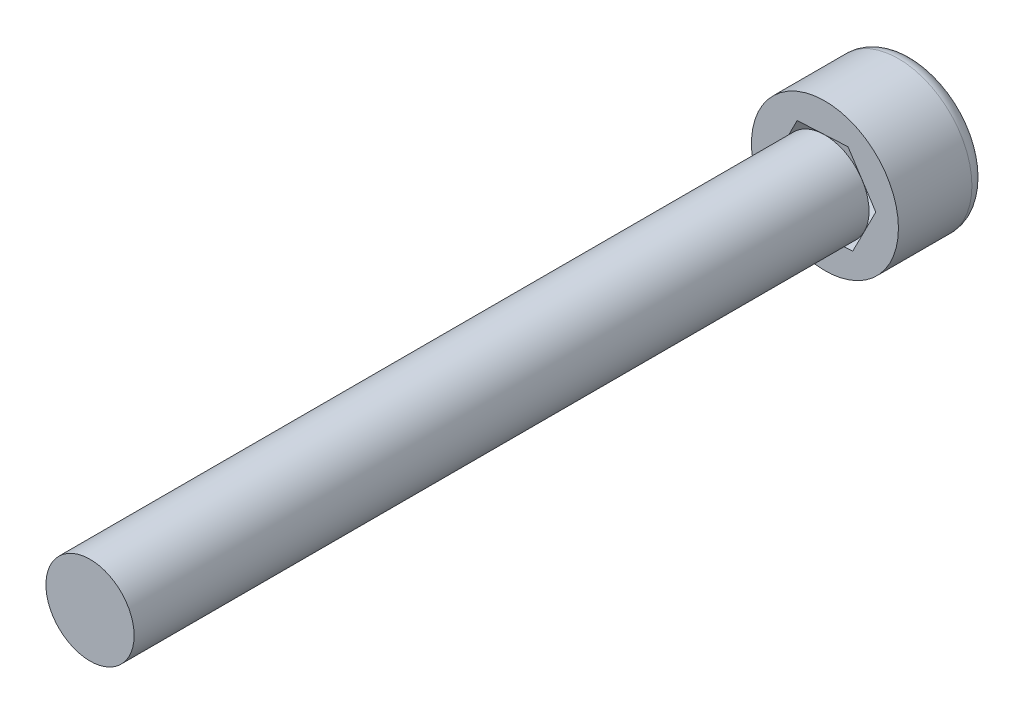
ISO-10303-21;
HEADER;
FILE_DESCRIPTION(('STEP AP214'),'2;1');
FILE_NAME('part.step','',(''),(''),'','','');
FILE_SCHEMA(('AUTOMOTIVE_DESIGN { 1 0 10303 214 1 1 1 1 }'));
ENDSEC;
DATA;
#1=APPLICATION_CONTEXT('core data for automotive mechanical design processes');
#2=APPLICATION_PROTOCOL_DEFINITION('international standard','automotive_design',2000,#1);
#3=PRODUCT_CONTEXT('',#1,'mechanical');
#4=PRODUCT('Part','Part','',(#3));
#5=PRODUCT_RELATED_PRODUCT_CATEGORY('part','',(#4));
#6=PRODUCT_DEFINITION_FORMATION('','',#4);
#7=PRODUCT_DEFINITION_CONTEXT('part definition',#1,'design');
#8=PRODUCT_DEFINITION('design','',#6,#7);
#9=PRODUCT_DEFINITION_SHAPE('','',#8);
#10=(LENGTH_UNIT() NAMED_UNIT(*) SI_UNIT(.MILLI.,.METRE.));
#11=(NAMED_UNIT(*) PLANE_ANGLE_UNIT() SI_UNIT($,.RADIAN.));
#12=(NAMED_UNIT(*) SI_UNIT($,.STERADIAN.) SOLID_ANGLE_UNIT());
#13=UNCERTAINTY_MEASURE_WITH_UNIT(LENGTH_MEASURE(1.E-05),#10,'distance_accuracy_value','');
#14=(GEOMETRIC_REPRESENTATION_CONTEXT(3) GLOBAL_UNCERTAINTY_ASSIGNED_CONTEXT((#13)) GLOBAL_UNIT_ASSIGNED_CONTEXT((#10,
#11,#12)) REPRESENTATION_CONTEXT('',''));
#15=CARTESIAN_POINT('',(0.,0.,0.));
#16=DIRECTION('',(0.,0.,1.));
#17=DIRECTION('',(1.,0.,0.));
#18=AXIS2_PLACEMENT_3D('',#15,#16,#17);
#19=CARTESIAN_POINT('',(0.,0.,3.));
#20=DIRECTION('',(0.,0.,-1.));
#21=DIRECTION('',(-1.,0.,0.));
#22=AXIS2_PLACEMENT_3D('',#19,#20,#21);
#23=CYLINDRICAL_SURFACE('',#22,2.5);
#24=CARTESIAN_POINT('',(0.,0.,0.5));
#25=DIRECTION('',(0.,0.,1.));
#26=DIRECTION('',(1.,0.,0.));
#27=AXIS2_PLACEMENT_3D('',#24,#25,#26);
#28=CIRCLE('',#27,2.5);
#29=CARTESIAN_POINT('',(2.5,0.,0.5));
#30=VERTEX_POINT('',#29);
#31=EDGE_CURVE('E50',#30,#30,#28,.T.);
#32=ORIENTED_EDGE('',*,*,#31,.T.);
#33=EDGE_LOOP('',(#32));
#34=FACE_BOUND('',#33,.T.);
#35=CARTESIAN_POINT('',(0.,0.,3.));
#36=DIRECTION('',(0.,0.,1.));
#37=DIRECTION('',(1.,0.,0.));
#38=AXIS2_PLACEMENT_3D('',#35,#36,#37);
#39=CIRCLE('',#38,2.5);
#40=CARTESIAN_POINT('',(2.5,0.,3.));
#41=VERTEX_POINT('',#40);
#42=EDGE_CURVE('E165',#41,#41,#39,.T.);
#43=ORIENTED_EDGE('',*,*,#42,.F.);
#44=EDGE_LOOP('',(#43));
#45=FACE_BOUND('',#44,.T.);
#46=ADVANCED_FACE('F41',(#34,#45),#23,.T.);
#47=CARTESIAN_POINT('',(0.,0.,3.));
#48=DIRECTION('',(0.,0.,1.));
#49=DIRECTION('',(1.,0.,0.));
#50=AXIS2_PLACEMENT_3D('',#47,#48,#49);
#51=PLANE('',#50);
#52=DIRECTION('',(-0.998565318577122,-0.0535472178079434,0.));
#53=VECTOR('',#52,1.);
#54=CARTESIAN_POINT('',(0.945103759937804,-1.45147472694203,3.));
#55=LINE('',#54,#53);
#56=CARTESIAN_POINT('',(0.945103759937804,-1.45147472694203,3.));
#57=VERTEX_POINT('',#56);
#58=CARTESIAN_POINT('',(-0.784462106513973,-1.54422122878934,3.));
#59=VERTEX_POINT('',#58);
#60=EDGE_CURVE('E94',#57,#59,#55,.T.);
#61=ORIENTED_EDGE('',*,*,#60,.T.);
#62=DIRECTION('',(-0.545655910212218,0.838009324321917,0.));
#63=VECTOR('',#62,1.);
#64=CARTESIAN_POINT('',(-0.784462106513973,-1.54422122878934,3.));
#65=LINE('',#64,#63);
#66=CARTESIAN_POINT('',(-1.72956586645178,-0.0927465018473138,3.));
#67=VERTEX_POINT('',#66);
#68=EDGE_CURVE('E57',#59,#67,#65,.T.);
#69=ORIENTED_EDGE('',*,*,#68,.T.);
#70=DIRECTION('',(0.452909408364904,0.89155654212986,0.));
#71=VECTOR('',#70,1.);
#72=CARTESIAN_POINT('',(-1.72956586645178,-0.0927465018473138,3.));
#73=LINE('',#72,#71);
#74=CARTESIAN_POINT('',(-0.945103759937803,1.45147472694203,3.));
#75=VERTEX_POINT('',#74);
#76=EDGE_CURVE('E104',#67,#75,#73,.T.);
#77=ORIENTED_EDGE('',*,*,#76,.T.);
#78=DIRECTION('',(0.998565318577122,0.0535472178079431,0.));
#79=VECTOR('',#78,1.);
#80=CARTESIAN_POINT('',(-0.945103759937803,1.45147472694203,3.));
#81=LINE('',#80,#79);
#82=CARTESIAN_POINT('',(0.784462106513974,1.54422122878934,3.));
#83=VERTEX_POINT('',#82);
#84=EDGE_CURVE('E176',#75,#83,#81,.T.);
#85=ORIENTED_EDGE('',*,*,#84,.T.);
#86=DIRECTION('',(0.545655910212218,-0.838009324321917,0.));
#87=VECTOR('',#86,1.);
#88=CARTESIAN_POINT('',(0.784462106513974,1.54422122878934,3.));
#89=LINE('',#88,#87);
#90=CARTESIAN_POINT('',(1.72956586645178,0.0927465018473145,3.));
#91=VERTEX_POINT('',#90);
#92=EDGE_CURVE('E174',#83,#91,#89,.T.);
#93=ORIENTED_EDGE('',*,*,#92,.T.);
#94=DIRECTION('',(-0.452909408364904,-0.89155654212986,0.));
#95=VECTOR('',#94,1.);
#96=CARTESIAN_POINT('',(1.72956586645178,0.0927465018473145,3.));
#97=LINE('',#96,#95);
#98=EDGE_CURVE('E109',#91,#57,#97,.T.);
#99=ORIENTED_EDGE('',*,*,#98,.T.);
#100=EDGE_LOOP('',(#61,#69,#77,#85,#93,#99));
#101=FACE_BOUND('',#100,.T.);
#102=ORIENTED_EDGE('',*,*,#42,.T.);
#103=EDGE_LOOP('',(#102));
#104=FACE_BOUND('',#103,.T.);
#105=ADVANCED_FACE('F106',(#101,#104),#51,.T.);
#106=CARTESIAN_POINT('',(0.,0.,0.));
#107=DIRECTION('',(0.,0.,1.));
#108=DIRECTION('',(1.,0.,0.));
#109=AXIS2_PLACEMENT_3D('',#106,#107,#108);
#110=PLANE('',#109);
#111=CARTESIAN_POINT('',(0.,0.,0.));
#112=DIRECTION('',(0.,0.,1.));
#113=DIRECTION('',(1.,0.,0.));
#114=AXIS2_PLACEMENT_3D('',#111,#112,#113);
#115=CIRCLE('',#114,2.);
#116=CARTESIAN_POINT('',(2.,0.,0.));
#117=VERTEX_POINT('',#116);
#118=EDGE_CURVE('E12',#117,#117,#115,.F.);
#119=ORIENTED_EDGE('',*,*,#118,.T.);
#120=EDGE_LOOP('',(#119));
#121=FACE_BOUND('',#120,.T.);
#122=DIRECTION('',(-0.545655910212218,0.838009324321917,0.));
#123=VECTOR('',#122,1.);
#124=CARTESIAN_POINT('',(-0.784462106513973,-1.54422122878934,0.));
#125=LINE('',#124,#123);
#126=CARTESIAN_POINT('',(-0.784462106513973,-1.54422122878934,0.));
#127=VERTEX_POINT('',#126);
#128=CARTESIAN_POINT('',(-1.72956586645178,-0.0927465018473138,0.));
#129=VERTEX_POINT('',#128);
#130=EDGE_CURVE('E99',#127,#129,#125,.T.);
#131=ORIENTED_EDGE('',*,*,#130,.F.);
#132=DIRECTION('',(-0.998565318577122,-0.0535472178079434,0.));
#133=VECTOR('',#132,1.);
#134=CARTESIAN_POINT('',(0.945103759937804,-1.45147472694203,0.));
#135=LINE('',#134,#133);
#136=CARTESIAN_POINT('',(0.945103759937804,-1.45147472694203,0.));
#137=VERTEX_POINT('',#136);
#138=EDGE_CURVE('E90',#137,#127,#135,.T.);
#139=ORIENTED_EDGE('',*,*,#138,.F.);
#140=DIRECTION('',(-0.452909408364904,-0.89155654212986,0.));
#141=VECTOR('',#140,1.);
#142=CARTESIAN_POINT('',(1.72956586645178,0.0927465018473145,0.));
#143=LINE('',#142,#141);
#144=CARTESIAN_POINT('',(1.72956586645178,0.0927465018473145,0.));
#145=VERTEX_POINT('',#144);
#146=EDGE_CURVE('E156',#145,#137,#143,.T.);
#147=ORIENTED_EDGE('',*,*,#146,.F.);
#148=DIRECTION('',(0.545655910212218,-0.838009324321917,0.));
#149=VECTOR('',#148,1.);
#150=CARTESIAN_POINT('',(0.784462106513974,1.54422122878934,0.));
#151=LINE('',#150,#149);
#152=CARTESIAN_POINT('',(0.784462106513974,1.54422122878934,0.));
#153=VERTEX_POINT('',#152);
#154=EDGE_CURVE('E189',#153,#145,#151,.T.);
#155=ORIENTED_EDGE('',*,*,#154,.F.);
#156=DIRECTION('',(0.998565318577122,0.0535472178079431,0.));
#157=VECTOR('',#156,1.);
#158=CARTESIAN_POINT('',(-0.945103759937803,1.45147472694203,0.));
#159=LINE('',#158,#157);
#160=CARTESIAN_POINT('',(-0.945103759937803,1.45147472694203,0.));
#161=VERTEX_POINT('',#160);
#162=EDGE_CURVE('E185',#161,#153,#159,.T.);
#163=ORIENTED_EDGE('',*,*,#162,.F.);
#164=DIRECTION('',(0.452909408364904,0.89155654212986,0.));
#165=VECTOR('',#164,1.);
#166=CARTESIAN_POINT('',(-1.72956586645178,-0.0927465018473138,0.));
#167=LINE('',#166,#165);
#168=EDGE_CURVE('E182',#129,#161,#167,.T.);
#169=ORIENTED_EDGE('',*,*,#168,.F.);
#170=EDGE_LOOP('',(#131,#139,#147,#155,#163,#169));
#171=FACE_BOUND('',#170,.T.);
#172=ADVANCED_FACE('F131',(#121,#171),#110,.F.);
#173=CARTESIAN_POINT('',(0.945103759937804,-1.45147472694203,3.));
#174=DIRECTION('',(0.0535472178079434,-0.998565318577122,0.));
#175=DIRECTION('',(0.998565318577122,0.0535472178079434,0.));
#176=AXIS2_PLACEMENT_3D('',#173,#174,#175);
#177=PLANE('',#176);
#178=ORIENTED_EDGE('',*,*,#138,.T.);
#179=DIRECTION('',(0.,0.,-1.));
#180=VECTOR('',#179,1.);
#181=CARTESIAN_POINT('',(-0.784462106513973,-1.54422122878934,3.));
#182=LINE('',#181,#180);
#183=EDGE_CURVE('E92',#59,#127,#182,.T.);
#184=ORIENTED_EDGE('',*,*,#183,.F.);
#185=ORIENTED_EDGE('',*,*,#60,.F.);
#186=DIRECTION('',(0.,0.,-1.));
#187=VECTOR('',#186,1.);
#188=CARTESIAN_POINT('',(0.945103759937804,-1.45147472694203,3.));
#189=LINE('',#188,#187);
#190=EDGE_CURVE('E157',#57,#137,#189,.T.);
#191=ORIENTED_EDGE('',*,*,#190,.T.);
#192=EDGE_LOOP('',(#178,#184,#185,#191));
#193=FACE_BOUND('',#192,.T.);
#194=ADVANCED_FACE('F93',(#193),#177,.F.);
#195=CARTESIAN_POINT('',(1.72956586645178,0.0927465018473145,3.));
#196=DIRECTION('',(0.89155654212986,-0.452909408364904,0.));
#197=DIRECTION('',(0.452909408364904,0.89155654212986,0.));
#198=AXIS2_PLACEMENT_3D('',#195,#196,#197);
#199=PLANE('',#198);
#200=ORIENTED_EDGE('',*,*,#146,.T.);
#201=ORIENTED_EDGE('',*,*,#190,.F.);
#202=ORIENTED_EDGE('',*,*,#98,.F.);
#203=DIRECTION('',(0.,0.,-1.));
#204=VECTOR('',#203,1.);
#205=CARTESIAN_POINT('',(1.72956586645178,0.0927465018473145,3.));
#206=LINE('',#205,#204);
#207=EDGE_CURVE('E159',#91,#145,#206,.T.);
#208=ORIENTED_EDGE('',*,*,#207,.T.);
#209=EDGE_LOOP('',(#200,#201,#202,#208));
#210=FACE_BOUND('',#209,.T.);
#211=ADVANCED_FACE('F138',(#210),#199,.F.);
#212=CARTESIAN_POINT('',(0.784462106513974,1.54422122878934,3.));
#213=DIRECTION('',(0.838009324321917,0.545655910212218,0.));
#214=DIRECTION('',(-0.545655910212218,0.838009324321917,0.));
#215=AXIS2_PLACEMENT_3D('',#212,#213,#214);
#216=PLANE('',#215);
#217=ORIENTED_EDGE('',*,*,#154,.T.);
#218=ORIENTED_EDGE('',*,*,#207,.F.);
#219=ORIENTED_EDGE('',*,*,#92,.F.);
#220=DIRECTION('',(0.,0.,-1.));
#221=VECTOR('',#220,1.);
#222=CARTESIAN_POINT('',(0.784462106513974,1.54422122878934,3.));
#223=LINE('',#222,#221);
#224=EDGE_CURVE('E187',#83,#153,#223,.T.);
#225=ORIENTED_EDGE('',*,*,#224,.T.);
#226=EDGE_LOOP('',(#217,#218,#219,#225));
#227=FACE_BOUND('',#226,.T.);
#228=ADVANCED_FACE('F146',(#227),#216,.F.);
#229=CARTESIAN_POINT('',(-0.945103759937803,1.45147472694203,3.));
#230=DIRECTION('',(-0.0535472178079431,0.998565318577122,0.));
#231=DIRECTION('',(-0.998565318577122,-0.0535472178079432,0.));
#232=AXIS2_PLACEMENT_3D('',#229,#230,#231);
#233=PLANE('',#232);
#234=ORIENTED_EDGE('',*,*,#162,.T.);
#235=ORIENTED_EDGE('',*,*,#224,.F.);
#236=ORIENTED_EDGE('',*,*,#84,.F.);
#237=DIRECTION('',(0.,0.,-1.));
#238=VECTOR('',#237,1.);
#239=CARTESIAN_POINT('',(-0.945103759937803,1.45147472694203,3.));
#240=LINE('',#239,#238);
#241=EDGE_CURVE('E181',#75,#161,#240,.T.);
#242=ORIENTED_EDGE('',*,*,#241,.T.);
#243=EDGE_LOOP('',(#234,#235,#236,#242));
#244=FACE_BOUND('',#243,.T.);
#245=ADVANCED_FACE('F142',(#244),#233,.F.);
#246=CARTESIAN_POINT('',(-1.72956586645178,-0.0927465018473138,3.));
#247=DIRECTION('',(-0.89155654212986,0.452909408364904,0.));
#248=DIRECTION('',(-0.452909408364904,-0.89155654212986,0.));
#249=AXIS2_PLACEMENT_3D('',#246,#247,#248);
#250=PLANE('',#249);
#251=ORIENTED_EDGE('',*,*,#168,.T.);
#252=ORIENTED_EDGE('',*,*,#241,.F.);
#253=ORIENTED_EDGE('',*,*,#76,.F.);
#254=DIRECTION('',(0.,0.,-1.));
#255=VECTOR('',#254,1.);
#256=CARTESIAN_POINT('',(-1.72956586645178,-0.0927465018473138,3.));
#257=LINE('',#256,#255);
#258=EDGE_CURVE('E102',#67,#129,#257,.T.);
#259=ORIENTED_EDGE('',*,*,#258,.T.);
#260=EDGE_LOOP('',(#251,#252,#253,#259));
#261=FACE_BOUND('',#260,.T.);
#262=ADVANCED_FACE('F123',(#261),#250,.F.);
#263=CARTESIAN_POINT('',(-0.784462106513973,-1.54422122878934,3.));
#264=DIRECTION('',(-0.838009324321917,-0.545655910212218,0.));
#265=DIRECTION('',(0.545655910212218,-0.838009324321917,0.));
#266=AXIS2_PLACEMENT_3D('',#263,#264,#265);
#267=PLANE('',#266);
#268=ORIENTED_EDGE('',*,*,#130,.T.);
#269=ORIENTED_EDGE('',*,*,#258,.F.);
#270=ORIENTED_EDGE('',*,*,#68,.F.);
#271=ORIENTED_EDGE('',*,*,#183,.T.);
#272=EDGE_LOOP('',(#268,#269,#270,#271));
#273=FACE_BOUND('',#272,.T.);
#274=ADVANCED_FACE('F101',(#273),#267,.F.);
#275=CARTESIAN_POINT('',(0.,0.,0.5));
#276=DIRECTION('',(0.,0.,1.));
#277=DIRECTION('',(1.,0.,0.));
#278=AXIS2_PLACEMENT_3D('',#275,#276,#277);
#279=TOROIDAL_SURFACE('',#278,2.,0.5);
#280=ORIENTED_EDGE('',*,*,#118,.F.);
#281=EDGE_LOOP('',(#280));
#282=FACE_BOUND('',#281,.T.);
#283=ORIENTED_EDGE('',*,*,#31,.F.);
#284=EDGE_LOOP('',(#283));
#285=FACE_BOUND('',#284,.T.);
#286=ADVANCED_FACE('F43',(#282,#285),#279,.T.);
#287=CLOSED_SHELL('',(#46,#105,#172,#194,#211,#228,#245,#262,#274,#286));
#288=MANIFOLD_SOLID_BREP('B2',#287);
#289=CARTESIAN_POINT('',(0.,0.,28.));
#290=DIRECTION('',(0.,0.,1.));
#291=DIRECTION('',(1.,0.,0.));
#292=AXIS2_PLACEMENT_3D('',#289,#290,#291);
#293=PLANE('',#292);
#294=CARTESIAN_POINT('',(0.,0.,28.));
#295=DIRECTION('',(0.,0.,1.));
#296=DIRECTION('',(1.,0.,0.));
#297=AXIS2_PLACEMENT_3D('',#294,#295,#296);
#298=CIRCLE('',#297,1.5);
#299=CARTESIAN_POINT('',(1.5,0.,28.));
#300=VERTEX_POINT('',#299);
#301=EDGE_CURVE('E260',#300,#300,#298,.T.);
#302=ORIENTED_EDGE('',*,*,#301,.T.);
#303=EDGE_LOOP('',(#302));
#304=FACE_BOUND('',#303,.T.);
#305=ADVANCED_FACE('F253',(#304),#293,.T.);
#306=CARTESIAN_POINT('',(0.,0.,28.));
#307=DIRECTION('',(0.,0.,-1.));
#308=DIRECTION('',(-1.,0.,0.));
#309=AXIS2_PLACEMENT_3D('',#306,#307,#308);
#310=CYLINDRICAL_SURFACE('',#309,1.5);
#311=ORIENTED_EDGE('',*,*,#301,.F.);
#312=EDGE_LOOP('',(#311));
#313=FACE_BOUND('',#312,.T.);
#314=CARTESIAN_POINT('',(0.,0.,3.));
#315=DIRECTION('',(0.,0.,1.));
#316=DIRECTION('',(1.,0.,0.));
#317=AXIS2_PLACEMENT_3D('',#314,#315,#316);
#318=CIRCLE('',#317,1.5);
#319=CARTESIAN_POINT('',(1.5,0.,3.));
#320=VERTEX_POINT('',#319);
#321=EDGE_CURVE('E40',#320,#320,#318,.T.);
#322=ORIENTED_EDGE('',*,*,#321,.T.);
#323=EDGE_LOOP('',(#322));
#324=FACE_BOUND('',#323,.T.);
#325=ADVANCED_FACE('F255',(#313,#324),#310,.T.);
#326=CARTESIAN_POINT('',(0.,0.,3.));
#327=DIRECTION('',(0.,0.,-1.));
#328=DIRECTION('',(-1.,0.,0.));
#329=AXIS2_PLACEMENT_3D('',#326,#327,#328);
#330=PLANE('',#329);
#331=ORIENTED_EDGE('',*,*,#321,.F.);
#332=EDGE_LOOP('',(#331));
#333=FACE_BOUND('',#332,.T.);
#334=ADVANCED_FACE('F268',(#333),#330,.T.);
#335=CLOSED_SHELL('',(#305,#325,#334));
#336=MANIFOLD_SOLID_BREP('B6',#335);
#337=ADVANCED_BREP_SHAPE_REPRESENTATION('',(#18,#288,#336),#14);
#338=SHAPE_DEFINITION_REPRESENTATION(#9,#337);
ENDSEC;
END-ISO-10303-21;
